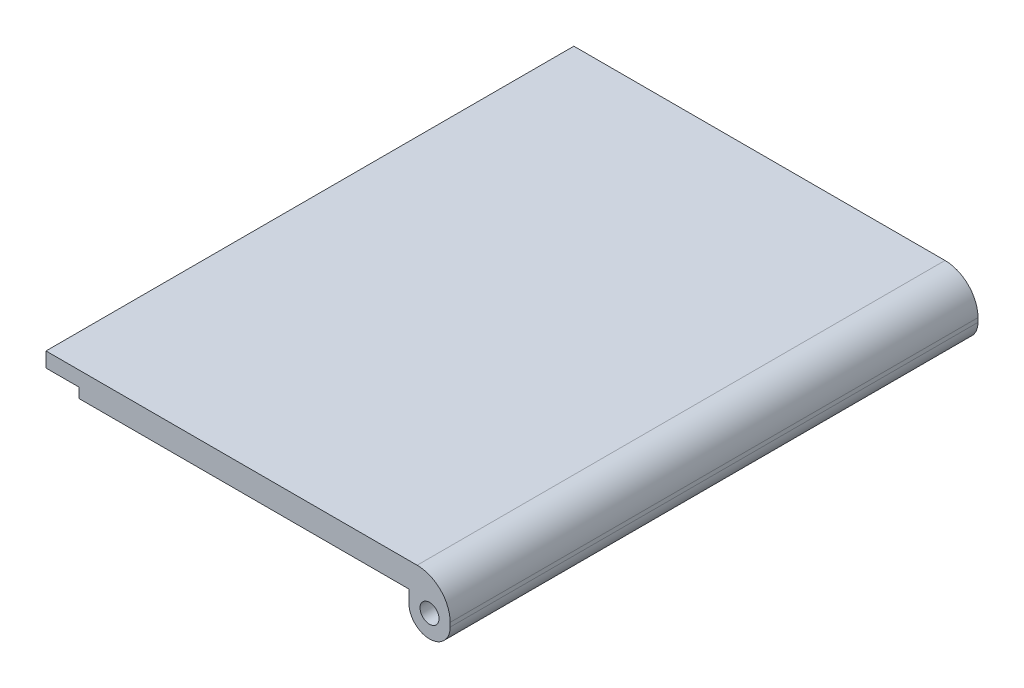
ISO-10303-21;
HEADER;
FILE_DESCRIPTION(('STEP AP214'),'2;1');
FILE_NAME('part.step','',(''),(''),'','','');
FILE_SCHEMA(('AUTOMOTIVE_DESIGN { 1 0 10303 214 1 1 1 1 }'));
ENDSEC;
DATA;
#1=APPLICATION_CONTEXT('core data for automotive mechanical design processes');
#2=APPLICATION_PROTOCOL_DEFINITION('international standard','automotive_design',2000,#1);
#3=PRODUCT_CONTEXT('',#1,'mechanical');
#4=PRODUCT('Part','Part','',(#3));
#5=PRODUCT_RELATED_PRODUCT_CATEGORY('part','',(#4));
#6=PRODUCT_DEFINITION_FORMATION('','',#4);
#7=PRODUCT_DEFINITION_CONTEXT('part definition',#1,'design');
#8=PRODUCT_DEFINITION('design','',#6,#7);
#9=PRODUCT_DEFINITION_SHAPE('','',#8);
#10=(LENGTH_UNIT() NAMED_UNIT(*) SI_UNIT(.MILLI.,.METRE.));
#11=(NAMED_UNIT(*) PLANE_ANGLE_UNIT() SI_UNIT($,.RADIAN.));
#12=(NAMED_UNIT(*) SI_UNIT($,.STERADIAN.) SOLID_ANGLE_UNIT());
#13=UNCERTAINTY_MEASURE_WITH_UNIT(LENGTH_MEASURE(1.E-05),#10,'distance_accuracy_value','');
#14=(GEOMETRIC_REPRESENTATION_CONTEXT(3) GLOBAL_UNCERTAINTY_ASSIGNED_CONTEXT((#13)) GLOBAL_UNIT_ASSIGNED_CONTEXT((#10,
#11,#12)) REPRESENTATION_CONTEXT('',''));
#15=CARTESIAN_POINT('',(0.,0.,0.));
#16=DIRECTION('',(0.,0.,1.));
#17=DIRECTION('',(1.,0.,0.));
#18=AXIS2_PLACEMENT_3D('',#15,#16,#17);
#19=CARTESIAN_POINT('',(0.,0.,0.));
#20=DIRECTION('',(0.,1.,0.));
#21=DIRECTION('',(0.,0.,1.));
#22=AXIS2_PLACEMENT_3D('',#19,#20,#21);
#23=PLANE('',#22);
#24=DIRECTION('',(1.,0.,0.));
#25=VECTOR('',#24,1.);
#26=CARTESIAN_POINT('',(-24.5,0.,32.));
#27=LINE('',#26,#25);
#28=CARTESIAN_POINT('',(-20.5,0.,32.));
#29=VERTEX_POINT('',#28);
#30=CARTESIAN_POINT('',(19.5,0.,32.));
#31=VERTEX_POINT('',#30);
#32=EDGE_CURVE('E198',#29,#31,#27,.T.);
#33=ORIENTED_EDGE('',*,*,#32,.F.);
#34=CARTESIAN_POINT('',(-24.5,0.,32.));
#35=DIRECTION('',(0.,-1.,0.));
#36=DIRECTION('',(0.,0.,-1.));
#37=AXIS2_PLACEMENT_3D('',#34,#35,#36);
#38=CIRCLE('',#37,4.);
#39=CARTESIAN_POINT('',(-24.5,0.,28.));
#40=VERTEX_POINT('',#39);
#41=EDGE_CURVE('E130',#40,#29,#38,.T.);
#42=ORIENTED_EDGE('',*,*,#41,.F.);
#43=DIRECTION('',(0.,0.,1.));
#44=VECTOR('',#43,1.);
#45=CARTESIAN_POINT('',(-24.5,0.,-32.));
#46=LINE('',#45,#44);
#47=CARTESIAN_POINT('',(-24.5,0.,-28.));
#48=VERTEX_POINT('',#47);
#49=EDGE_CURVE('E201',#48,#40,#46,.T.);
#50=ORIENTED_EDGE('',*,*,#49,.F.);
#51=CARTESIAN_POINT('',(-24.5,0.,-32.));
#52=DIRECTION('',(0.,-1.,0.));
#53=DIRECTION('',(0.,0.,1.));
#54=AXIS2_PLACEMENT_3D('',#51,#52,#53);
#55=CIRCLE('',#54,4.);
#56=CARTESIAN_POINT('',(-20.5,0.,-32.));
#57=VERTEX_POINT('',#56);
#58=EDGE_CURVE('E218',#57,#48,#55,.T.);
#59=ORIENTED_EDGE('',*,*,#58,.F.);
#60=DIRECTION('',(-1.,0.,0.));
#61=VECTOR('',#60,1.);
#62=CARTESIAN_POINT('',(-24.5,0.,-32.));
#63=LINE('',#62,#61);
#64=CARTESIAN_POINT('',(19.5,0.,-32.));
#65=VERTEX_POINT('',#64);
#66=EDGE_CURVE('E207',#65,#57,#63,.T.);
#67=ORIENTED_EDGE('',*,*,#66,.F.);
#68=DIRECTION('',(0.,0.,-1.));
#69=VECTOR('',#68,1.);
#70=CARTESIAN_POINT('',(19.5,0.,32.));
#71=LINE('',#70,#69);
#72=EDGE_CURVE('E238',#31,#65,#71,.T.);
#73=ORIENTED_EDGE('',*,*,#72,.F.);
#74=EDGE_LOOP('',(#33,#42,#50,#59,#67,#73));
#75=FACE_BOUND('',#74,.T.);
#76=ADVANCED_FACE('F37',(#75),#23,.F.);
#77=CARTESIAN_POINT('',(24.5,3.,-32.));
#78=DIRECTION('',(-1.,0.,0.));
#79=DIRECTION('',(0.,0.,1.));
#80=AXIS2_PLACEMENT_3D('',#77,#78,#79);
#81=PLANE('',#80);
#82=DIRECTION('',(0.,-1.,0.));
#83=VECTOR('',#82,1.);
#84=CARTESIAN_POINT('',(24.5,3.,-32.));
#85=LINE('',#84,#83);
#86=CARTESIAN_POINT('',(24.5,-1.,-32.));
#87=VERTEX_POINT('',#86);
#88=CARTESIAN_POINT('',(24.5,-1.5,-32.));
#89=VERTEX_POINT('',#88);
#90=EDGE_CURVE('E149',#87,#89,#85,.T.);
#91=ORIENTED_EDGE('',*,*,#90,.F.);
#92=DIRECTION('',(0.,0.,-1.));
#93=VECTOR('',#92,1.);
#94=CARTESIAN_POINT('',(24.5,-1.,32.));
#95=LINE('',#94,#93);
#96=CARTESIAN_POINT('',(24.5,-1.,32.));
#97=VERTEX_POINT('',#96);
#98=EDGE_CURVE('E45',#87,#97,#95,.F.);
#99=ORIENTED_EDGE('',*,*,#98,.T.);
#100=DIRECTION('',(0.,-1.,0.));
#101=VECTOR('',#100,1.);
#102=CARTESIAN_POINT('',(24.5,3.,32.));
#103=LINE('',#102,#101);
#104=CARTESIAN_POINT('',(24.5,-1.5,32.));
#105=VERTEX_POINT('',#104);
#106=EDGE_CURVE('E146',#97,#105,#103,.T.);
#107=ORIENTED_EDGE('',*,*,#106,.T.);
#108=DIRECTION('',(0.,0.,1.));
#109=VECTOR('',#108,1.);
#110=CARTESIAN_POINT('',(24.5,-1.5,-32.));
#111=LINE('',#110,#109);
#112=EDGE_CURVE('E160',#105,#89,#111,.F.);
#113=ORIENTED_EDGE('',*,*,#112,.T.);
#114=EDGE_LOOP('',(#91,#99,#107,#113));
#115=FACE_BOUND('',#114,.T.);
#116=ADVANCED_FACE('F182',(#115),#81,.F.);
#117=CARTESIAN_POINT('',(-24.5,3.,-32.));
#118=DIRECTION('',(0.,0.,1.));
#119=DIRECTION('',(1.,0.,0.));
#120=AXIS2_PLACEMENT_3D('',#117,#118,#119);
#121=PLANE('',#120);
#122=CARTESIAN_POINT('',(22.,-1.3,-32.));
#123=DIRECTION('',(0.,0.,-1.));
#124=DIRECTION('',(-1.,0.,0.));
#125=AXIS2_PLACEMENT_3D('',#122,#123,#124);
#126=CIRCLE('',#125,1.15);
#127=CARTESIAN_POINT('',(20.85,-1.3,-32.));
#128=VERTEX_POINT('',#127);
#129=EDGE_CURVE('E173',#128,#128,#126,.T.);
#130=ORIENTED_EDGE('',*,*,#129,.F.);
#131=EDGE_LOOP('',(#130));
#132=FACE_BOUND('',#131,.T.);
#133=ORIENTED_EDGE('',*,*,#66,.T.);
#134=DIRECTION('',(0.,-1.,0.));
#135=VECTOR('',#134,1.);
#136=CARTESIAN_POINT('',(-20.5,1.2,-32.));
#137=LINE('',#136,#135);
#138=CARTESIAN_POINT('',(-20.5,1.2,-32.));
#139=VERTEX_POINT('',#138);
#140=EDGE_CURVE('E222',#139,#57,#137,.T.);
#141=ORIENTED_EDGE('',*,*,#140,.F.);
#142=DIRECTION('',(1.,0.,0.));
#143=VECTOR('',#142,1.);
#144=CARTESIAN_POINT('',(-24.5,1.2,-32.));
#145=LINE('',#144,#143);
#146=CARTESIAN_POINT('',(-24.5,1.2,-32.));
#147=VERTEX_POINT('',#146);
#148=EDGE_CURVE('E228',#147,#139,#145,.T.);
#149=ORIENTED_EDGE('',*,*,#148,.F.);
#150=DIRECTION('',(0.,-1.,0.));
#151=VECTOR('',#150,1.);
#152=CARTESIAN_POINT('',(-24.5,3.,-32.));
#153=LINE('',#152,#151);
#154=CARTESIAN_POINT('',(-24.5,3.,-32.));
#155=VERTEX_POINT('',#154);
#156=EDGE_CURVE('E145',#155,#147,#153,.T.);
#157=ORIENTED_EDGE('',*,*,#156,.F.);
#158=DIRECTION('',(-1.,0.,0.));
#159=VECTOR('',#158,1.);
#160=CARTESIAN_POINT('',(-24.5,3.,-32.));
#161=LINE('',#160,#159);
#162=CARTESIAN_POINT('',(20.5,3.,-32.));
#163=VERTEX_POINT('',#162);
#164=EDGE_CURVE('E191',#163,#155,#161,.T.);
#165=ORIENTED_EDGE('',*,*,#164,.F.);
#166=CARTESIAN_POINT('',(20.5,-1.,-32.));
#167=DIRECTION('',(0.,0.,1.));
#168=DIRECTION('',(1.,0.,0.));
#169=AXIS2_PLACEMENT_3D('',#166,#167,#168);
#170=CIRCLE('',#169,4.);
#171=EDGE_CURVE('E177',#163,#87,#170,.F.);
#172=ORIENTED_EDGE('',*,*,#171,.T.);
#173=ORIENTED_EDGE('',*,*,#90,.T.);
#174=CARTESIAN_POINT('',(22.,-1.5,-32.));
#175=DIRECTION('',(0.,0.,1.));
#176=DIRECTION('',(1.,0.,0.));
#177=AXIS2_PLACEMENT_3D('',#174,#175,#176);
#178=CIRCLE('',#177,2.5);
#179=CARTESIAN_POINT('',(22.,-4.,-32.));
#180=VERTEX_POINT('',#179);
#181=EDGE_CURVE('E165',#89,#180,#178,.F.);
#182=ORIENTED_EDGE('',*,*,#181,.T.);
#183=CARTESIAN_POINT('',(22.,-1.5,-32.));
#184=DIRECTION('',(0.,0.,1.));
#185=DIRECTION('',(1.,0.,0.));
#186=AXIS2_PLACEMENT_3D('',#183,#184,#185);
#187=CIRCLE('',#186,2.5);
#188=CARTESIAN_POINT('',(19.5,-1.5,-32.));
#189=VERTEX_POINT('',#188);
#190=EDGE_CURVE('E163',#180,#189,#187,.F.);
#191=ORIENTED_EDGE('',*,*,#190,.T.);
#192=DIRECTION('',(0.,1.,0.));
#193=VECTOR('',#192,1.);
#194=CARTESIAN_POINT('',(19.5,-4.,-32.));
#195=LINE('',#194,#193);
#196=EDGE_CURVE('E242',#189,#65,#195,.T.);
#197=ORIENTED_EDGE('',*,*,#196,.T.);
#198=EDGE_LOOP('',(#133,#141,#149,#157,#165,#172,#173,#182,#191,#197));
#199=FACE_BOUND('',#198,.T.);
#200=ADVANCED_FACE('F195',(#132,#199),#121,.F.);
#201=CARTESIAN_POINT('',(-24.5,3.,-32.));
#202=DIRECTION('',(1.,0.,0.));
#203=DIRECTION('',(0.,0.,-1.));
#204=AXIS2_PLACEMENT_3D('',#201,#202,#203);
#205=PLANE('',#204);
#206=ORIENTED_EDGE('',*,*,#49,.T.);
#207=DIRECTION('',(0.,-1.,0.));
#208=VECTOR('',#207,1.);
#209=CARTESIAN_POINT('',(-24.5,1.2,28.));
#210=LINE('',#209,#208);
#211=CARTESIAN_POINT('',(-24.5,1.2,28.));
#212=VERTEX_POINT('',#211);
#213=EDGE_CURVE('E140',#212,#40,#210,.T.);
#214=ORIENTED_EDGE('',*,*,#213,.F.);
#215=DIRECTION('',(0.,0.,-1.));
#216=VECTOR('',#215,1.);
#217=CARTESIAN_POINT('',(-24.5,1.2,28.));
#218=LINE('',#217,#216);
#219=CARTESIAN_POINT('',(-24.5,1.2,32.));
#220=VERTEX_POINT('',#219);
#221=EDGE_CURVE('E126',#220,#212,#218,.T.);
#222=ORIENTED_EDGE('',*,*,#221,.F.);
#223=DIRECTION('',(0.,-1.,0.));
#224=VECTOR('',#223,1.);
#225=CARTESIAN_POINT('',(-24.5,3.,32.));
#226=LINE('',#225,#224);
#227=CARTESIAN_POINT('',(-24.5,3.,32.));
#228=VERTEX_POINT('',#227);
#229=EDGE_CURVE('E138',#228,#220,#226,.T.);
#230=ORIENTED_EDGE('',*,*,#229,.F.);
#231=DIRECTION('',(0.,0.,1.));
#232=VECTOR('',#231,1.);
#233=CARTESIAN_POINT('',(-24.5,3.,-32.));
#234=LINE('',#233,#232);
#235=EDGE_CURVE('E197',#155,#228,#234,.T.);
#236=ORIENTED_EDGE('',*,*,#235,.F.);
#237=ORIENTED_EDGE('',*,*,#156,.T.);
#238=DIRECTION('',(0.,0.,-1.));
#239=VECTOR('',#238,1.);
#240=CARTESIAN_POINT('',(-24.5,1.2,-28.));
#241=LINE('',#240,#239);
#242=CARTESIAN_POINT('',(-24.5,1.2,-28.));
#243=VERTEX_POINT('',#242);
#244=EDGE_CURVE('E231',#243,#147,#241,.T.);
#245=ORIENTED_EDGE('',*,*,#244,.F.);
#246=DIRECTION('',(0.,-1.,0.));
#247=VECTOR('',#246,1.);
#248=CARTESIAN_POINT('',(-24.5,1.2,-28.));
#249=LINE('',#248,#247);
#250=EDGE_CURVE('E212',#243,#48,#249,.T.);
#251=ORIENTED_EDGE('',*,*,#250,.T.);
#252=EDGE_LOOP('',(#206,#214,#222,#230,#236,#237,#245,#251));
#253=FACE_BOUND('',#252,.T.);
#254=ADVANCED_FACE('F136',(#253),#205,.F.);
#255=CARTESIAN_POINT('',(-24.5,3.,32.));
#256=DIRECTION('',(0.,0.,-1.));
#257=DIRECTION('',(-1.,0.,0.));
#258=AXIS2_PLACEMENT_3D('',#255,#256,#257);
#259=PLANE('',#258);
#260=CARTESIAN_POINT('',(22.,-1.3,32.));
#261=DIRECTION('',(0.,0.,-1.));
#262=DIRECTION('',(-1.,0.,0.));
#263=AXIS2_PLACEMENT_3D('',#260,#261,#262);
#264=CIRCLE('',#263,1.15);
#265=CARTESIAN_POINT('',(20.85,-1.3,32.));
#266=VERTEX_POINT('',#265);
#267=EDGE_CURVE('E235',#266,#266,#264,.T.);
#268=ORIENTED_EDGE('',*,*,#267,.T.);
#269=EDGE_LOOP('',(#268));
#270=FACE_BOUND('',#269,.T.);
#271=DIRECTION('',(-1.,0.,0.));
#272=VECTOR('',#271,1.);
#273=CARTESIAN_POINT('',(-24.5,1.2,32.));
#274=LINE('',#273,#272);
#275=CARTESIAN_POINT('',(-20.5,1.2,32.));
#276=VERTEX_POINT('',#275);
#277=EDGE_CURVE('E123',#276,#220,#274,.T.);
#278=ORIENTED_EDGE('',*,*,#277,.F.);
#279=DIRECTION('',(0.,-1.,0.));
#280=VECTOR('',#279,1.);
#281=CARTESIAN_POINT('',(-20.5,1.2,32.));
#282=LINE('',#281,#280);
#283=EDGE_CURVE('E174',#276,#29,#282,.T.);
#284=ORIENTED_EDGE('',*,*,#283,.T.);
#285=ORIENTED_EDGE('',*,*,#32,.T.);
#286=DIRECTION('',(0.,1.,0.));
#287=VECTOR('',#286,1.);
#288=CARTESIAN_POINT('',(19.5,-4.,32.));
#289=LINE('',#288,#287);
#290=CARTESIAN_POINT('',(19.5,-1.5,32.));
#291=VERTEX_POINT('',#290);
#292=EDGE_CURVE('E203',#291,#31,#289,.T.);
#293=ORIENTED_EDGE('',*,*,#292,.F.);
#294=CARTESIAN_POINT('',(22.,-1.5,32.));
#295=DIRECTION('',(0.,0.,-1.));
#296=DIRECTION('',(-1.,0.,0.));
#297=AXIS2_PLACEMENT_3D('',#294,#295,#296);
#298=CIRCLE('',#297,2.5);
#299=CARTESIAN_POINT('',(22.,-4.,32.));
#300=VERTEX_POINT('',#299);
#301=EDGE_CURVE('E155',#291,#300,#298,.F.);
#302=ORIENTED_EDGE('',*,*,#301,.T.);
#303=CARTESIAN_POINT('',(22.,-1.5,32.));
#304=DIRECTION('',(0.,0.,-1.));
#305=DIRECTION('',(-1.,0.,0.));
#306=AXIS2_PLACEMENT_3D('',#303,#304,#305);
#307=CIRCLE('',#306,2.5);
#308=EDGE_CURVE('E157',#300,#105,#307,.F.);
#309=ORIENTED_EDGE('',*,*,#308,.T.);
#310=ORIENTED_EDGE('',*,*,#106,.F.);
#311=CARTESIAN_POINT('',(20.5,-1.,32.));
#312=DIRECTION('',(0.,0.,-1.));
#313=DIRECTION('',(-1.,0.,0.));
#314=AXIS2_PLACEMENT_3D('',#311,#312,#313);
#315=CIRCLE('',#314,4.);
#316=CARTESIAN_POINT('',(20.5,3.,32.));
#317=VERTEX_POINT('',#316);
#318=EDGE_CURVE('E11',#97,#317,#315,.F.);
#319=ORIENTED_EDGE('',*,*,#318,.T.);
#320=DIRECTION('',(1.,0.,0.));
#321=VECTOR('',#320,1.);
#322=CARTESIAN_POINT('',(-24.5,3.,32.));
#323=LINE('',#322,#321);
#324=EDGE_CURVE('E144',#228,#317,#323,.T.);
#325=ORIENTED_EDGE('',*,*,#324,.F.);
#326=ORIENTED_EDGE('',*,*,#229,.T.);
#327=EDGE_LOOP('',(#278,#284,#285,#293,#302,#309,#310,#319,#325,#326));
#328=FACE_BOUND('',#327,.T.);
#329=ADVANCED_FACE('F142',(#270,#328),#259,.F.);
#330=CARTESIAN_POINT('',(0.,3.,0.));
#331=DIRECTION('',(0.,1.,0.));
#332=DIRECTION('',(0.,0.,1.));
#333=AXIS2_PLACEMENT_3D('',#330,#331,#332);
#334=PLANE('',#333);
#335=ORIENTED_EDGE('',*,*,#324,.T.);
#336=DIRECTION('',(0.,0.,-1.));
#337=VECTOR('',#336,1.);
#338=CARTESIAN_POINT('',(20.5,3.,-32.));
#339=LINE('',#338,#337);
#340=EDGE_CURVE('E169',#317,#163,#339,.T.);
#341=ORIENTED_EDGE('',*,*,#340,.T.);
#342=ORIENTED_EDGE('',*,*,#164,.T.);
#343=ORIENTED_EDGE('',*,*,#235,.T.);
#344=EDGE_LOOP('',(#335,#341,#342,#343));
#345=FACE_BOUND('',#344,.T.);
#346=ADVANCED_FACE('F190',(#345),#334,.T.);
#347=CARTESIAN_POINT('',(19.5,-4.,32.));
#348=DIRECTION('',(1.,0.,0.));
#349=DIRECTION('',(0.,0.,-1.));
#350=AXIS2_PLACEMENT_3D('',#347,#348,#349);
#351=PLANE('',#350);
#352=ORIENTED_EDGE('',*,*,#196,.F.);
#353=DIRECTION('',(0.,0.,-1.));
#354=VECTOR('',#353,1.);
#355=CARTESIAN_POINT('',(19.5,-1.5,32.));
#356=LINE('',#355,#354);
#357=EDGE_CURVE('E167',#189,#291,#356,.F.);
#358=ORIENTED_EDGE('',*,*,#357,.T.);
#359=ORIENTED_EDGE('',*,*,#292,.T.);
#360=ORIENTED_EDGE('',*,*,#72,.T.);
#361=EDGE_LOOP('',(#352,#358,#359,#360));
#362=FACE_BOUND('',#361,.T.);
#363=ADVANCED_FACE('F247',(#362),#351,.F.);
#364=CARTESIAN_POINT('',(22.,-1.3,32.));
#365=DIRECTION('',(0.,0.,-1.));
#366=DIRECTION('',(-1.,0.,0.));
#367=AXIS2_PLACEMENT_3D('',#364,#365,#366);
#368=CYLINDRICAL_SURFACE('',#367,1.15);
#369=ORIENTED_EDGE('',*,*,#267,.F.);
#370=EDGE_LOOP('',(#369));
#371=FACE_BOUND('',#370,.T.);
#372=ORIENTED_EDGE('',*,*,#129,.T.);
#373=EDGE_LOOP('',(#372));
#374=FACE_BOUND('',#373,.T.);
#375=ADVANCED_FACE('F283',(#371,#374),#368,.F.);
#376=CARTESIAN_POINT('',(22.,-1.5,0.));
#377=DIRECTION('',(0.,0.,-1.));
#378=DIRECTION('',(-1.,0.,0.));
#379=AXIS2_PLACEMENT_3D('',#376,#377,#378);
#380=CYLINDRICAL_SURFACE('',#379,2.5);
#381=ORIENTED_EDGE('',*,*,#357,.F.);
#382=ORIENTED_EDGE('',*,*,#190,.F.);
#383=DIRECTION('',(0.,0.,-1.));
#384=VECTOR('',#383,1.);
#385=CARTESIAN_POINT('',(22.,-4.,0.));
#386=LINE('',#385,#384);
#387=EDGE_CURVE('E170',#300,#180,#386,.T.);
#388=ORIENTED_EDGE('',*,*,#387,.F.);
#389=ORIENTED_EDGE('',*,*,#301,.F.);
#390=EDGE_LOOP('',(#381,#382,#388,#389));
#391=FACE_BOUND('',#390,.T.);
#392=ADVANCED_FACE('F280',(#391),#380,.T.);
#393=CARTESIAN_POINT('',(22.,-1.5,0.));
#394=DIRECTION('',(0.,0.,1.));
#395=DIRECTION('',(1.,0.,0.));
#396=AXIS2_PLACEMENT_3D('',#393,#394,#395);
#397=CYLINDRICAL_SURFACE('',#396,2.5);
#398=ORIENTED_EDGE('',*,*,#181,.F.);
#399=ORIENTED_EDGE('',*,*,#112,.F.);
#400=ORIENTED_EDGE('',*,*,#308,.F.);
#401=ORIENTED_EDGE('',*,*,#387,.T.);
#402=EDGE_LOOP('',(#398,#399,#400,#401));
#403=FACE_BOUND('',#402,.T.);
#404=ADVANCED_FACE('F278',(#403),#397,.T.);
#405=CARTESIAN_POINT('',(20.5,-1.,0.));
#406=DIRECTION('',(0.,0.,1.));
#407=DIRECTION('',(1.,0.,0.));
#408=AXIS2_PLACEMENT_3D('',#405,#406,#407);
#409=CYLINDRICAL_SURFACE('',#408,4.);
#410=ORIENTED_EDGE('',*,*,#318,.F.);
#411=ORIENTED_EDGE('',*,*,#98,.F.);
#412=ORIENTED_EDGE('',*,*,#171,.F.);
#413=ORIENTED_EDGE('',*,*,#340,.F.);
#414=EDGE_LOOP('',(#410,#411,#412,#413));
#415=FACE_BOUND('',#414,.T.);
#416=ADVANCED_FACE('F39',(#415),#409,.T.);
#417=CARTESIAN_POINT('',(-24.5,1.2,32.));
#418=DIRECTION('',(0.,-1.,0.));
#419=DIRECTION('',(0.,0.,-1.));
#420=AXIS2_PLACEMENT_3D('',#417,#418,#419);
#421=CYLINDRICAL_SURFACE('',#420,4.);
#422=ORIENTED_EDGE('',*,*,#41,.T.);
#423=ORIENTED_EDGE('',*,*,#283,.F.);
#424=CARTESIAN_POINT('',(-24.5,1.2,32.));
#425=DIRECTION('',(0.,-1.,0.));
#426=DIRECTION('',(0.,0.,-1.));
#427=AXIS2_PLACEMENT_3D('',#424,#425,#426);
#428=CIRCLE('',#427,4.);
#429=EDGE_CURVE('E60',#212,#276,#428,.T.);
#430=ORIENTED_EDGE('',*,*,#429,.F.);
#431=ORIENTED_EDGE('',*,*,#213,.T.);
#432=EDGE_LOOP('',(#422,#423,#430,#431));
#433=FACE_BOUND('',#432,.T.);
#434=ADVANCED_FACE('F368',(#433),#421,.F.);
#435=CARTESIAN_POINT('',(-24.5,1.2,32.));
#436=DIRECTION('',(0.,-1.,0.));
#437=DIRECTION('',(0.,0.,-1.));
#438=AXIS2_PLACEMENT_3D('',#435,#436,#437);
#439=PLANE('',#438);
#440=ORIENTED_EDGE('',*,*,#277,.T.);
#441=ORIENTED_EDGE('',*,*,#221,.T.);
#442=ORIENTED_EDGE('',*,*,#429,.T.);
#443=EDGE_LOOP('',(#440,#441,#442));
#444=FACE_BOUND('',#443,.T.);
#445=ADVANCED_FACE('F125',(#444),#439,.T.);
#446=CARTESIAN_POINT('',(-24.5,1.2,-32.));
#447=DIRECTION('',(0.,-1.,0.));
#448=DIRECTION('',(0.,0.,-1.));
#449=AXIS2_PLACEMENT_3D('',#446,#447,#448);
#450=CYLINDRICAL_SURFACE('',#449,4.);
#451=ORIENTED_EDGE('',*,*,#58,.T.);
#452=ORIENTED_EDGE('',*,*,#250,.F.);
#453=CARTESIAN_POINT('',(-24.5,1.2,-32.));
#454=DIRECTION('',(0.,-1.,0.));
#455=DIRECTION('',(0.,0.,1.));
#456=AXIS2_PLACEMENT_3D('',#453,#454,#455);
#457=CIRCLE('',#456,4.);
#458=EDGE_CURVE('E52',#139,#243,#457,.T.);
#459=ORIENTED_EDGE('',*,*,#458,.F.);
#460=ORIENTED_EDGE('',*,*,#140,.T.);
#461=EDGE_LOOP('',(#451,#452,#459,#460));
#462=FACE_BOUND('',#461,.T.);
#463=ADVANCED_FACE('F252',(#462),#450,.F.);
#464=CARTESIAN_POINT('',(-24.5,1.2,-32.));
#465=DIRECTION('',(0.,1.,0.));
#466=DIRECTION('',(0.,0.,1.));
#467=AXIS2_PLACEMENT_3D('',#464,#465,#466);
#468=PLANE('',#467);
#469=ORIENTED_EDGE('',*,*,#148,.T.);
#470=ORIENTED_EDGE('',*,*,#458,.T.);
#471=ORIENTED_EDGE('',*,*,#244,.T.);
#472=EDGE_LOOP('',(#469,#470,#471));
#473=FACE_BOUND('',#472,.T.);
#474=ADVANCED_FACE('F253',(#473),#468,.F.);
#475=CLOSED_SHELL('',(#76,#116,#200,#254,#329,#346,#363,#375,#392,#404,#416,#434,#445,#463,#474));
#476=MANIFOLD_SOLID_BREP('B2',#475);
#477=ADVANCED_BREP_SHAPE_REPRESENTATION('',(#18,#476),#14);
#478=SHAPE_DEFINITION_REPRESENTATION(#9,#477);
ENDSEC;
END-ISO-10303-21;
